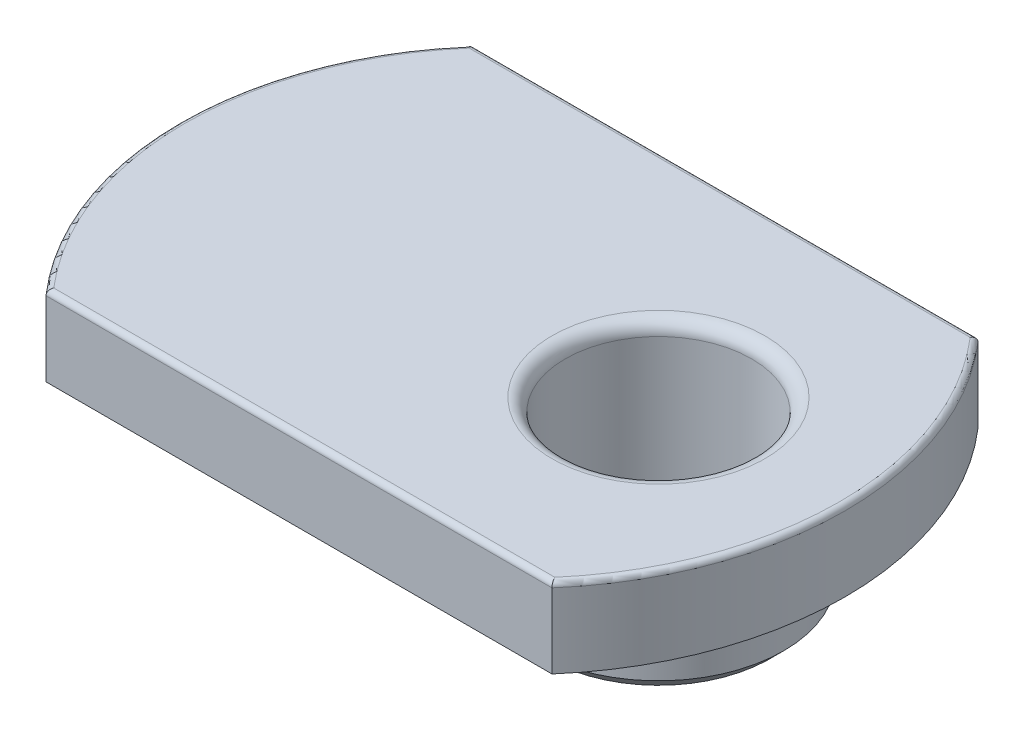
ISO-10303-21;
HEADER;
FILE_DESCRIPTION(('STEP AP214'),'2;1');
FILE_NAME('part.step','',(''),(''),'','','');
FILE_SCHEMA(('AUTOMOTIVE_DESIGN { 1 0 10303 214 1 1 1 1 }'));
ENDSEC;
DATA;
#1=APPLICATION_CONTEXT('core data for automotive mechanical design processes');
#2=APPLICATION_PROTOCOL_DEFINITION('international standard','automotive_design',2000,#1);
#3=PRODUCT_CONTEXT('',#1,'mechanical');
#4=PRODUCT('Part','Part','',(#3));
#5=PRODUCT_RELATED_PRODUCT_CATEGORY('part','',(#4));
#6=PRODUCT_DEFINITION_FORMATION('','',#4);
#7=PRODUCT_DEFINITION_CONTEXT('part definition',#1,'design');
#8=PRODUCT_DEFINITION('design','',#6,#7);
#9=PRODUCT_DEFINITION_SHAPE('','',#8);
#10=(LENGTH_UNIT() NAMED_UNIT(*) SI_UNIT(.MILLI.,.METRE.));
#11=(NAMED_UNIT(*) PLANE_ANGLE_UNIT() SI_UNIT($,.RADIAN.));
#12=(NAMED_UNIT(*) SI_UNIT($,.STERADIAN.) SOLID_ANGLE_UNIT());
#13=UNCERTAINTY_MEASURE_WITH_UNIT(LENGTH_MEASURE(1.E-05),#10,'distance_accuracy_value','');
#14=(GEOMETRIC_REPRESENTATION_CONTEXT(3) GLOBAL_UNCERTAINTY_ASSIGNED_CONTEXT((#13)) GLOBAL_UNIT_ASSIGNED_CONTEXT((#10,
#11,#12)) REPRESENTATION_CONTEXT('',''));
#15=CARTESIAN_POINT('',(0.,0.,0.));
#16=DIRECTION('',(0.,0.,1.));
#17=DIRECTION('',(1.,0.,0.));
#18=AXIS2_PLACEMENT_3D('',#15,#16,#17);
#19=CARTESIAN_POINT('',(0.333333333333326,3.,0.));
#20=DIRECTION('',(0.,-1.,0.));
#21=DIRECTION('',(0.,0.,-1.));
#22=AXIS2_PLACEMENT_3D('',#19,#20,#21);
#23=CYLINDRICAL_SURFACE('',#22,12.1666666666667);
#24=DIRECTION('',(0.,-1.,0.));
#25=VECTOR('',#24,1.);
#26=CARTESIAN_POINT('',(9.5,3.,-8.00000000000001));
#27=LINE('',#26,#25);
#28=CARTESIAN_POINT('',(9.5,2.8,-8.00000000000001));
#29=VERTEX_POINT('',#28);
#30=CARTESIAN_POINT('',(9.5,0.,-8.00000000000001));
#31=VERTEX_POINT('',#30);
#32=EDGE_CURVE('E72',#29,#31,#27,.T.);
#33=ORIENTED_EDGE('',*,*,#32,.F.);
#34=CARTESIAN_POINT('',(0.333333333333326,2.8,0.));
#35=DIRECTION('',(0.,-1.,0.));
#36=DIRECTION('',(0.,0.,-1.));
#37=AXIS2_PLACEMENT_3D('',#34,#35,#36);
#38=CIRCLE('',#37,12.1666666666667);
#39=CARTESIAN_POINT('',(9.5,2.8,8.00000000000001));
#40=VERTEX_POINT('',#39);
#41=EDGE_CURVE('E132',#29,#40,#38,.T.);
#42=ORIENTED_EDGE('',*,*,#41,.T.);
#43=DIRECTION('',(0.,-1.,0.));
#44=VECTOR('',#43,1.);
#45=CARTESIAN_POINT('',(9.5,3.,8.00000000000001));
#46=LINE('',#45,#44);
#47=CARTESIAN_POINT('',(9.5,0.,8.00000000000001));
#48=VERTEX_POINT('',#47);
#49=EDGE_CURVE('E92',#40,#48,#46,.T.);
#50=ORIENTED_EDGE('',*,*,#49,.T.);
#51=CARTESIAN_POINT('',(0.333333333333326,0.,0.));
#52=DIRECTION('',(0.,1.,0.));
#53=DIRECTION('',(0.,0.,-1.));
#54=AXIS2_PLACEMENT_3D('',#51,#52,#53);
#55=CIRCLE('',#54,12.1666666666667);
#56=EDGE_CURVE('E87',#48,#31,#55,.T.);
#57=ORIENTED_EDGE('',*,*,#56,.T.);
#58=EDGE_LOOP('',(#33,#42,#50,#57));
#59=FACE_BOUND('',#58,.T.);
#60=ADVANCED_FACE('F16',(#59),#23,.T.);
#61=CARTESIAN_POINT('',(-9.5,3.,-8.));
#62=DIRECTION('',(0.,0.,1.));
#63=DIRECTION('',(1.,0.,0.));
#64=AXIS2_PLACEMENT_3D('',#61,#62,#63);
#65=PLANE('',#64);
#66=DIRECTION('',(0.,-1.,0.));
#67=VECTOR('',#66,1.);
#68=CARTESIAN_POINT('',(-9.5,3.,-8.));
#69=LINE('',#68,#67);
#70=CARTESIAN_POINT('',(-9.5,2.8,-8.));
#71=VERTEX_POINT('',#70);
#72=CARTESIAN_POINT('',(-9.5,0.,-8.));
#73=VERTEX_POINT('',#72);
#74=EDGE_CURVE('E81',#71,#73,#69,.T.);
#75=ORIENTED_EDGE('',*,*,#74,.F.);
#76=DIRECTION('',(-1.,0.,0.));
#77=VECTOR('',#76,1.);
#78=CARTESIAN_POINT('',(-9.5,2.8,-8.));
#79=LINE('',#78,#77);
#80=EDGE_CURVE('E30',#71,#29,#79,.F.);
#81=ORIENTED_EDGE('',*,*,#80,.T.);
#82=ORIENTED_EDGE('',*,*,#32,.T.);
#83=DIRECTION('',(-1.,0.,0.));
#84=VECTOR('',#83,1.);
#85=CARTESIAN_POINT('',(-9.5,0.,-8.));
#86=LINE('',#85,#84);
#87=EDGE_CURVE('E75',#31,#73,#86,.T.);
#88=ORIENTED_EDGE('',*,*,#87,.T.);
#89=EDGE_LOOP('',(#75,#81,#82,#88));
#90=FACE_BOUND('',#89,.T.);
#91=ADVANCED_FACE('F74',(#90),#65,.F.);
#92=CARTESIAN_POINT('',(-0.333333333333324,3.,0.));
#93=DIRECTION('',(0.,-1.,0.));
#94=DIRECTION('',(0.,0.,-1.));
#95=AXIS2_PLACEMENT_3D('',#92,#93,#94);
#96=CYLINDRICAL_SURFACE('',#95,12.1666666666667);
#97=DIRECTION('',(0.,-1.,0.));
#98=VECTOR('',#97,1.);
#99=CARTESIAN_POINT('',(-9.50000000000001,3.,7.99999999999999));
#100=LINE('',#99,#98);
#101=CARTESIAN_POINT('',(-9.50000000000001,2.8,7.99999999999999));
#102=VERTEX_POINT('',#101);
#103=CARTESIAN_POINT('',(-9.50000000000001,0.,7.99999999999999));
#104=VERTEX_POINT('',#103);
#105=EDGE_CURVE('E103',#102,#104,#100,.T.);
#106=ORIENTED_EDGE('',*,*,#105,.F.);
#107=CARTESIAN_POINT('',(-0.333333333333324,2.8,0.));
#108=DIRECTION('',(0.,-1.,0.));
#109=DIRECTION('',(0.,0.,-1.));
#110=AXIS2_PLACEMENT_3D('',#107,#108,#109);
#111=CIRCLE('',#110,12.1666666666667);
#112=EDGE_CURVE('E10',#102,#71,#111,.T.);
#113=ORIENTED_EDGE('',*,*,#112,.T.);
#114=ORIENTED_EDGE('',*,*,#74,.T.);
#115=CARTESIAN_POINT('',(-0.333333333333324,0.,0.));
#116=DIRECTION('',(0.,1.,0.));
#117=DIRECTION('',(0.,0.,1.));
#118=AXIS2_PLACEMENT_3D('',#115,#116,#117);
#119=CIRCLE('',#118,12.1666666666667);
#120=EDGE_CURVE('E89',#73,#104,#119,.T.);
#121=ORIENTED_EDGE('',*,*,#120,.T.);
#122=EDGE_LOOP('',(#106,#113,#114,#121));
#123=FACE_BOUND('',#122,.T.);
#124=ADVANCED_FACE('F177',(#123),#96,.T.);
#125=CARTESIAN_POINT('',(-9.5,3.,8.));
#126=DIRECTION('',(0.,0.,-1.));
#127=DIRECTION('',(-1.,0.,0.));
#128=AXIS2_PLACEMENT_3D('',#125,#126,#127);
#129=PLANE('',#128);
#130=ORIENTED_EDGE('',*,*,#49,.F.);
#131=DIRECTION('',(1.,0.,0.));
#132=VECTOR('',#131,1.);
#133=CARTESIAN_POINT('',(-9.5,2.8,8.));
#134=LINE('',#133,#132);
#135=EDGE_CURVE('E129',#40,#102,#134,.F.);
#136=ORIENTED_EDGE('',*,*,#135,.T.);
#137=ORIENTED_EDGE('',*,*,#105,.T.);
#138=DIRECTION('',(1.,0.,0.));
#139=VECTOR('',#138,1.);
#140=CARTESIAN_POINT('',(-9.5,0.,8.));
#141=LINE('',#140,#139);
#142=EDGE_CURVE('E100',#104,#48,#141,.T.);
#143=ORIENTED_EDGE('',*,*,#142,.T.);
#144=EDGE_LOOP('',(#130,#136,#137,#143));
#145=FACE_BOUND('',#144,.T.);
#146=ADVANCED_FACE('F176',(#145),#129,.F.);
#147=CARTESIAN_POINT('',(0.333333333333326,3.,0.));
#148=DIRECTION('',(0.,-1.,0.));
#149=DIRECTION('',(0.,0.,-1.));
#150=AXIS2_PLACEMENT_3D('',#147,#148,#149);
#151=PLANE('',#150);
#152=CARTESIAN_POINT('',(-0.333333333333324,3.,0.));
#153=DIRECTION('',(0.,-1.,0.));
#154=DIRECTION('',(0.,0.,-1.));
#155=AXIS2_PLACEMENT_3D('',#152,#153,#154);
#156=CIRCLE('',#155,11.9666666666667);
#157=CARTESIAN_POINT('',(-9.40863559337465,3.,-7.8));
#158=VERTEX_POINT('',#157);
#159=CARTESIAN_POINT('',(-9.40863559337465,3.,7.8));
#160=VERTEX_POINT('',#159);
#161=EDGE_CURVE('E120',#158,#160,#156,.F.);
#162=ORIENTED_EDGE('',*,*,#161,.T.);
#163=DIRECTION('',(1.,0.,0.));
#164=VECTOR('',#163,1.);
#165=CARTESIAN_POINT('',(0.333333333333324,3.,7.8));
#166=LINE('',#165,#164);
#167=CARTESIAN_POINT('',(9.40863559337465,3.,7.80000000000001));
#168=VERTEX_POINT('',#167);
#169=EDGE_CURVE('E126',#160,#168,#166,.T.);
#170=ORIENTED_EDGE('',*,*,#169,.T.);
#171=CARTESIAN_POINT('',(0.333333333333326,3.,0.));
#172=DIRECTION('',(0.,-1.,0.));
#173=DIRECTION('',(0.,0.,-1.));
#174=AXIS2_PLACEMENT_3D('',#171,#172,#173);
#175=CIRCLE('',#174,11.9666666666667);
#176=CARTESIAN_POINT('',(9.40863559337465,3.,-7.80000000000001));
#177=VERTEX_POINT('',#176);
#178=EDGE_CURVE('E124',#168,#177,#175,.F.);
#179=ORIENTED_EDGE('',*,*,#178,.T.);
#180=DIRECTION('',(-1.,0.,0.));
#181=VECTOR('',#180,1.);
#182=CARTESIAN_POINT('',(0.333333333333324,3.,-7.8));
#183=LINE('',#182,#181);
#184=EDGE_CURVE('E122',#177,#158,#183,.T.);
#185=ORIENTED_EDGE('',*,*,#184,.T.);
#186=EDGE_LOOP('',(#162,#170,#179,#185));
#187=FACE_BOUND('',#186,.T.);
#188=CARTESIAN_POINT('',(5.5,3.,0.));
#189=DIRECTION('',(0.,-1.,0.));
#190=DIRECTION('',(0.,0.,-1.));
#191=AXIS2_PLACEMENT_3D('',#188,#189,#190);
#192=CIRCLE('',#191,4.);
#193=CARTESIAN_POINT('',(5.5,3.,-4.));
#194=VERTEX_POINT('',#193);
#195=EDGE_CURVE('E111',#194,#194,#192,.T.);
#196=ORIENTED_EDGE('',*,*,#195,.T.);
#197=EDGE_LOOP('',(#196));
#198=FACE_BOUND('',#197,.T.);
#199=ADVANCED_FACE('F181',(#187,#198),#151,.F.);
#200=CARTESIAN_POINT('',(0.333333333333326,0.,0.));
#201=DIRECTION('',(0.,-1.,0.));
#202=DIRECTION('',(0.,0.,-1.));
#203=AXIS2_PLACEMENT_3D('',#200,#201,#202);
#204=PLANE('',#203);
#205=CARTESIAN_POINT('',(5.5,0.,0.));
#206=DIRECTION('',(0.,-1.,0.));
#207=DIRECTION('',(0.,0.,-1.));
#208=AXIS2_PLACEMENT_3D('',#205,#206,#207);
#209=CIRCLE('',#208,4.7);
#210=CARTESIAN_POINT('',(5.5,0.,-4.7));
#211=VERTEX_POINT('',#210);
#212=EDGE_CURVE('E80',#211,#211,#209,.T.);
#213=ORIENTED_EDGE('',*,*,#212,.F.);
#214=EDGE_LOOP('',(#213));
#215=FACE_BOUND('',#214,.T.);
#216=ORIENTED_EDGE('',*,*,#56,.F.);
#217=ORIENTED_EDGE('',*,*,#142,.F.);
#218=ORIENTED_EDGE('',*,*,#120,.F.);
#219=ORIENTED_EDGE('',*,*,#87,.F.);
#220=EDGE_LOOP('',(#216,#217,#218,#219));
#221=FACE_BOUND('',#220,.T.);
#222=ADVANCED_FACE('F85',(#215,#221),#204,.T.);
#223=CARTESIAN_POINT('',(5.5,-3.4,0.));
#224=DIRECTION('',(0.,1.,0.));
#225=DIRECTION('',(0.,0.,1.));
#226=AXIS2_PLACEMENT_3D('',#223,#224,#225);
#227=CYLINDRICAL_SURFACE('',#226,4.7);
#228=CARTESIAN_POINT('',(5.5,-2.9,0.));
#229=DIRECTION('',(0.,1.,0.));
#230=DIRECTION('',(0.,0.,1.));
#231=AXIS2_PLACEMENT_3D('',#228,#229,#230);
#232=CIRCLE('',#231,4.7);
#233=CARTESIAN_POINT('',(5.5,-2.9,4.7));
#234=VERTEX_POINT('',#233);
#235=EDGE_CURVE('E114',#234,#234,#232,.T.);
#236=ORIENTED_EDGE('',*,*,#235,.T.);
#237=EDGE_LOOP('',(#236));
#238=FACE_BOUND('',#237,.T.);
#239=ORIENTED_EDGE('',*,*,#212,.T.);
#240=EDGE_LOOP('',(#239));
#241=FACE_BOUND('',#240,.T.);
#242=ADVANCED_FACE('F202',(#238,#241),#227,.T.);
#243=CARTESIAN_POINT('',(5.5,-3.4,0.));
#244=DIRECTION('',(0.,1.,0.));
#245=DIRECTION('',(0.,0.,1.));
#246=AXIS2_PLACEMENT_3D('',#243,#244,#245);
#247=PLANE('',#246);
#248=CARTESIAN_POINT('',(5.5,-3.4,0.));
#249=DIRECTION('',(0.,1.,0.));
#250=DIRECTION('',(0.,0.,1.));
#251=AXIS2_PLACEMENT_3D('',#248,#249,#250);
#252=CIRCLE('',#251,4.2);
#253=CARTESIAN_POINT('',(5.5,-3.4,4.2));
#254=VERTEX_POINT('',#253);
#255=EDGE_CURVE('E117',#254,#254,#252,.F.);
#256=ORIENTED_EDGE('',*,*,#255,.T.);
#257=EDGE_LOOP('',(#256));
#258=FACE_BOUND('',#257,.T.);
#259=CARTESIAN_POINT('',(5.5,-3.4,0.));
#260=DIRECTION('',(0.,1.,0.));
#261=DIRECTION('',(0.,0.,1.));
#262=AXIS2_PLACEMENT_3D('',#259,#260,#261);
#263=CIRCLE('',#262,3.5);
#264=CARTESIAN_POINT('',(5.5,-3.4,3.5));
#265=VERTEX_POINT('',#264);
#266=EDGE_CURVE('E94',#265,#265,#263,.T.);
#267=ORIENTED_EDGE('',*,*,#266,.T.);
#268=EDGE_LOOP('',(#267));
#269=FACE_BOUND('',#268,.T.);
#270=ADVANCED_FACE('F197',(#258,#269),#247,.F.);
#271=CARTESIAN_POINT('',(5.5,-3.4,0.));
#272=DIRECTION('',(0.,1.,0.));
#273=DIRECTION('',(0.,0.,1.));
#274=AXIS2_PLACEMENT_3D('',#271,#272,#273);
#275=CYLINDRICAL_SURFACE('',#274,3.5);
#276=CARTESIAN_POINT('',(5.5,2.5,0.));
#277=DIRECTION('',(0.,-1.,0.));
#278=DIRECTION('',(0.,0.,-1.));
#279=AXIS2_PLACEMENT_3D('',#276,#277,#278);
#280=CIRCLE('',#279,3.5);
#281=CARTESIAN_POINT('',(5.5,2.5,-3.5));
#282=VERTEX_POINT('',#281);
#283=EDGE_CURVE('E108',#282,#282,#280,.F.);
#284=ORIENTED_EDGE('',*,*,#283,.T.);
#285=EDGE_LOOP('',(#284));
#286=FACE_BOUND('',#285,.T.);
#287=ORIENTED_EDGE('',*,*,#266,.F.);
#288=EDGE_LOOP('',(#287));
#289=FACE_BOUND('',#288,.T.);
#290=ADVANCED_FACE('F191',(#286,#289),#275,.F.);
#291=CARTESIAN_POINT('',(5.5,2.5,0.));
#292=DIRECTION('',(0.,-1.,0.));
#293=DIRECTION('',(0.,0.,-1.));
#294=AXIS2_PLACEMENT_3D('',#291,#292,#293);
#295=TOROIDAL_SURFACE('',#294,4.,0.5);
#296=ORIENTED_EDGE('',*,*,#195,.F.);
#297=EDGE_LOOP('',(#296));
#298=FACE_BOUND('',#297,.T.);
#299=ORIENTED_EDGE('',*,*,#283,.F.);
#300=EDGE_LOOP('',(#299));
#301=FACE_BOUND('',#300,.T.);
#302=ADVANCED_FACE('F187',(#298,#301),#295,.T.);
#303=CARTESIAN_POINT('',(5.5,-2.9,0.));
#304=DIRECTION('',(0.,1.,0.));
#305=DIRECTION('',(0.,0.,1.));
#306=AXIS2_PLACEMENT_3D('',#303,#304,#305);
#307=CONICAL_SURFACE('',#306,4.7,0.785398163397454);
#308=ORIENTED_EDGE('',*,*,#255,.F.);
#309=EDGE_LOOP('',(#308));
#310=FACE_BOUND('',#309,.T.);
#311=ORIENTED_EDGE('',*,*,#235,.F.);
#312=EDGE_LOOP('',(#311));
#313=FACE_BOUND('',#312,.T.);
#314=ADVANCED_FACE('F190',(#310,#313),#307,.T.);
#315=CARTESIAN_POINT('',(0.333333333333324,2.8,-7.8));
#316=DIRECTION('',(-1.,0.,0.));
#317=DIRECTION('',(0.,0.,1.));
#318=AXIS2_PLACEMENT_3D('',#315,#316,#317);
#319=CYLINDRICAL_SURFACE('',#318,0.2);
#320=CARTESIAN_POINT('',(9.5,2.8,-8.00000000000001));
#321=CARTESIAN_POINT('',(9.50000550773872,2.81052686573057,-8.00001231347368));
#322=CARTESIAN_POINT('',(9.49962261417545,2.82104508503684,-7.9991697519459));
#323=CARTESIAN_POINT('',(9.49812359158818,2.84173916124319,-7.99587220544365));
#324=CARTESIAN_POINT('',(9.49700977708411,2.85191599260397,-7.99342231022606));
#325=CARTESIAN_POINT('',(9.494092573379,2.87166828965124,-7.98700761087605));
#326=CARTESIAN_POINT('',(9.49228946056287,2.88124399457945,-7.98304341392697));
#327=CARTESIAN_POINT('',(9.48806448906931,2.89956651906865,-7.97375843326175));
#328=CARTESIAN_POINT('',(9.48564233650279,2.90831294221667,-7.96843700520263));
#329=CARTESIAN_POINT('',(9.4801652429374,2.92508516936808,-7.95640981643723));
#330=CARTESIAN_POINT('',(9.47709063131787,2.93307360920113,-7.94966105222928));
#331=CARTESIAN_POINT('',(9.47046489790844,2.94781116551262,-7.93512613741905));
#332=CARTESIAN_POINT('',(9.46691361945866,2.95455987280977,-7.92733964576638));
#333=CARTESIAN_POINT('',(9.45911443095121,2.96723468228057,-7.91025037028477));
#334=CARTESIAN_POINT('',(9.45483296439409,2.97304208665028,-7.90087495736572));
#335=CARTESIAN_POINT('',(9.44594329290359,2.9830018174255,-7.8814235297573));
#336=CARTESIAN_POINT('',(9.4413349442053,2.98715341021128,-7.87134720684129));
#337=CARTESIAN_POINT('',(9.43230134536942,2.99348046878275,-7.85161068859139));
#338=CARTESIAN_POINT('',(9.42789281570729,2.99579172918783,-7.84198573917162));
#339=CARTESIAN_POINT('',(9.41898691254831,2.99896681922522,-7.82255641203511));
#340=CARTESIAN_POINT('',(9.41448972601697,2.99983342122318,-7.81275241457572));
#341=CARTESIAN_POINT('',(9.40953898743967,2.99999275469416,-7.80196773070985));
#342=CARTESIAN_POINT('',(9.40908727617098,3.00000001632601,-7.80098379723589));
#343=CARTESIAN_POINT('',(9.40863559337465,3.,-7.80000000000001));
#344=B_SPLINE_CURVE_WITH_KNOTS('',3,(#320,#321,#322,#323,#324,#325,#326,#327,#328,#329,#330,
#331,#332,#333,#334,#335,#336,#337,#338,#339,#340,#341,#342,#343),.UNSPECIFIED.,.F.,.F.,(4,2,2,
2,2,2,2,2,2,2,2,4),(0.,0.0315265272354055,0.0629537018137739,0.0943682883715399,
0.12579781679785,0.15836082108097,0.190934553747698,0.226277334101784,0.26163575599076,
0.294049077723656,0.32640012489754,0.329648085916069),.UNSPECIFIED.);
#345=EDGE_CURVE('E158',#29,#177,#344,.T.);
#346=ORIENTED_EDGE('',*,*,#345,.F.);
#347=ORIENTED_EDGE('',*,*,#80,.F.);
#348=CARTESIAN_POINT('',(-9.5,2.8,-8.));
#349=CARTESIAN_POINT('',(-9.50000550773873,2.81052686573057,-8.00001231347367));
#350=CARTESIAN_POINT('',(-9.49962261417545,2.82104508503684,-7.9991697519459));
#351=CARTESIAN_POINT('',(-9.49812359158819,2.84173916124319,-7.99587220544364));
#352=CARTESIAN_POINT('',(-9.49700977708411,2.85191599260397,-7.99342231022606));
#353=CARTESIAN_POINT('',(-9.49409257337901,2.87166828965124,-7.98700761087604));
#354=CARTESIAN_POINT('',(-9.49228946056287,2.88124399457945,-7.98304341392696));
#355=CARTESIAN_POINT('',(-9.48806448906932,2.89956651906865,-7.97375843326174));
#356=CARTESIAN_POINT('',(-9.48564233650279,2.90831294221667,-7.96843700520263));
#357=CARTESIAN_POINT('',(-9.48016524293741,2.92508516936808,-7.95640981643723));
#358=CARTESIAN_POINT('',(-9.47709063131788,2.93307360920112,-7.94966105222928));
#359=CARTESIAN_POINT('',(-9.47046489790845,2.94781116551262,-7.93512613741904));
#360=CARTESIAN_POINT('',(-9.46691361945867,2.95455987280977,-7.92733964576637));
#361=CARTESIAN_POINT('',(-9.45911443095122,2.96723468228057,-7.91025037028477));
#362=CARTESIAN_POINT('',(-9.45483296439409,2.97304208665028,-7.90087495736571));
#363=CARTESIAN_POINT('',(-9.44594329290358,2.9830018174255,-7.8814235297573));
#364=CARTESIAN_POINT('',(-9.4413349442053,2.98715341021128,-7.87134720684129));
#365=CARTESIAN_POINT('',(-9.43230134536942,2.99348046878275,-7.85161068859139));
#366=CARTESIAN_POINT('',(-9.42789281570729,2.99579172918783,-7.84198573917161));
#367=CARTESIAN_POINT('',(-9.41898691254832,2.99896681922522,-7.8225564120351));
#368=CARTESIAN_POINT('',(-9.41448972601698,2.99983342122318,-7.81275241457571));
#369=CARTESIAN_POINT('',(-9.40953898743968,2.99999275469416,-7.80196773070985));
#370=CARTESIAN_POINT('',(-9.40908727617099,3.00000001632601,-7.80098379723588));
#371=CARTESIAN_POINT('',(-9.40863559337465,3.,-7.8));
#372=B_SPLINE_CURVE_WITH_KNOTS('',3,(#348,#349,#350,#351,#352,#353,#354,#355,#356,#357,#358,
#359,#360,#361,#362,#363,#364,#365,#366,#367,#368,#369,#370,#371),.UNSPECIFIED.,.F.,.F.,(4,2,2,
2,2,2,2,2,2,2,2,4),(0.,0.0315265272354051,0.0629537018137734,0.0943682883715393,
0.125797816797849,0.158360821080969,0.190934553747697,0.226277334101783,0.261635755990758,
0.294049077723656,0.32640012489754,0.329648085916069),.UNSPECIFIED.);
#373=EDGE_CURVE('E21',#158,#71,#372,.F.);
#374=ORIENTED_EDGE('',*,*,#373,.F.);
#375=ORIENTED_EDGE('',*,*,#184,.F.);
#376=EDGE_LOOP('',(#346,#347,#374,#375));
#377=FACE_BOUND('',#376,.T.);
#378=ADVANCED_FACE('F18',(#377),#319,.T.);
#379=CARTESIAN_POINT('',(-0.333333333333324,2.8,0.));
#380=DIRECTION('',(0.,-1.,0.));
#381=DIRECTION('',(0.,0.,-1.));
#382=AXIS2_PLACEMENT_3D('',#379,#380,#381);
#383=TOROIDAL_SURFACE('',#382,11.9666666666667,0.2);
#384=ORIENTED_EDGE('',*,*,#373,.T.);
#385=ORIENTED_EDGE('',*,*,#112,.F.);
#386=CARTESIAN_POINT('',(-9.50000000000001,2.8,8.));
#387=CARTESIAN_POINT('',(-9.50000550773873,2.81052686573057,8.00001231347367));
#388=CARTESIAN_POINT('',(-9.49962261417545,2.82104508503684,7.9991697519459));
#389=CARTESIAN_POINT('',(-9.49812359158819,2.84173916124319,7.99587220544364));
#390=CARTESIAN_POINT('',(-9.49700977708411,2.85191599260397,7.99342231022606));
#391=CARTESIAN_POINT('',(-9.49409257337901,2.87166828965124,7.98700761087604));
#392=CARTESIAN_POINT('',(-9.49228946056287,2.88124399457945,7.98304341392696));
#393=CARTESIAN_POINT('',(-9.48806448906932,2.89956651906865,7.97375843326174));
#394=CARTESIAN_POINT('',(-9.48564233650279,2.90831294221667,7.96843700520263));
#395=CARTESIAN_POINT('',(-9.48016524293741,2.92508516936808,7.95640981643723));
#396=CARTESIAN_POINT('',(-9.47709063131788,2.93307360920112,7.94966105222928));
#397=CARTESIAN_POINT('',(-9.47046489790844,2.94781116551262,7.93512613741904));
#398=CARTESIAN_POINT('',(-9.46691361945867,2.95455987280977,7.92733964576637));
#399=CARTESIAN_POINT('',(-9.45911443095122,2.96723468228057,7.91025037028477));
#400=CARTESIAN_POINT('',(-9.45483296439409,2.97304208665028,7.90087495736571));
#401=CARTESIAN_POINT('',(-9.44594329290358,2.9830018174255,7.8814235297573));
#402=CARTESIAN_POINT('',(-9.4413349442053,2.98715341021128,7.87134720684129));
#403=CARTESIAN_POINT('',(-9.43230134536942,2.99348046878275,7.85161068859139));
#404=CARTESIAN_POINT('',(-9.42789281570729,2.99579172918783,7.84198573917161));
#405=CARTESIAN_POINT('',(-9.41898691254832,2.99896681922522,7.8225564120351));
#406=CARTESIAN_POINT('',(-9.41448972601698,2.99983342122318,7.81275241457571));
#407=CARTESIAN_POINT('',(-9.40953898743968,2.99999275469416,7.80196773070985));
#408=CARTESIAN_POINT('',(-9.40908727617099,3.00000001632601,7.80098379723588));
#409=CARTESIAN_POINT('',(-9.40863559337465,3.,7.8));
#410=B_SPLINE_CURVE_WITH_KNOTS('',3,(#386,#387,#388,#389,#390,#391,#392,#393,#394,#395,#396,
#397,#398,#399,#400,#401,#402,#403,#404,#405,#406,#407,#408,#409),.UNSPECIFIED.,.F.,.F.,(4,2,2,
2,2,2,2,2,2,2,2,4),(0.,0.0315265272354053,0.0629537018137733,0.0943682883715391,
0.125797816797849,0.158360821080969,0.190934553747697,0.226277334101783,0.261635755990758,
0.294049077723656,0.32640012489754,0.329648085916069),.UNSPECIFIED.);
#411=EDGE_CURVE('E143',#160,#102,#410,.F.);
#412=ORIENTED_EDGE('',*,*,#411,.F.);
#413=ORIENTED_EDGE('',*,*,#161,.F.);
#414=EDGE_LOOP('',(#384,#385,#412,#413));
#415=FACE_BOUND('',#414,.T.);
#416=ADVANCED_FACE('F154',(#415),#383,.T.);
#417=CARTESIAN_POINT('',(0.333333333333326,2.8,0.));
#418=DIRECTION('',(0.,-1.,0.));
#419=DIRECTION('',(0.,0.,-1.));
#420=AXIS2_PLACEMENT_3D('',#417,#418,#419);
#421=TOROIDAL_SURFACE('',#420,11.9666666666667,0.2);
#422=ORIENTED_EDGE('',*,*,#345,.T.);
#423=ORIENTED_EDGE('',*,*,#178,.F.);
#424=CARTESIAN_POINT('',(9.5,2.8,8.00000000000001));
#425=CARTESIAN_POINT('',(9.50000550773872,2.81052686573057,8.00001231347368));
#426=CARTESIAN_POINT('',(9.49962261417545,2.82104508503684,7.9991697519459));
#427=CARTESIAN_POINT('',(9.49812359158818,2.84173916124319,7.99587220544365));
#428=CARTESIAN_POINT('',(9.49700977708411,2.85191599260397,7.99342231022606));
#429=CARTESIAN_POINT('',(9.494092573379,2.87166828965124,7.98700761087605));
#430=CARTESIAN_POINT('',(9.49228946056287,2.88124399457945,7.98304341392697));
#431=CARTESIAN_POINT('',(9.48806448906931,2.89956651906865,7.97375843326175));
#432=CARTESIAN_POINT('',(9.48564233650279,2.90831294221667,7.96843700520263));
#433=CARTESIAN_POINT('',(9.4801652429374,2.92508516936808,7.95640981643723));
#434=CARTESIAN_POINT('',(9.47709063131787,2.93307360920113,7.94966105222928));
#435=CARTESIAN_POINT('',(9.47046489790844,2.94781116551262,7.93512613741905));
#436=CARTESIAN_POINT('',(9.46691361945866,2.95455987280977,7.92733964576638));
#437=CARTESIAN_POINT('',(9.45911443095121,2.96723468228057,7.91025037028477));
#438=CARTESIAN_POINT('',(9.45483296439409,2.97304208665028,7.90087495736572));
#439=CARTESIAN_POINT('',(9.44594329290359,2.9830018174255,7.8814235297573));
#440=CARTESIAN_POINT('',(9.4413349442053,2.98715341021128,7.87134720684129));
#441=CARTESIAN_POINT('',(9.43230134536942,2.99348046878275,7.85161068859139));
#442=CARTESIAN_POINT('',(9.42789281570729,2.99579172918783,7.84198573917162));
#443=CARTESIAN_POINT('',(9.41898691254831,2.99896681922522,7.82255641203511));
#444=CARTESIAN_POINT('',(9.41448972601697,2.99983342122318,7.81275241457572));
#445=CARTESIAN_POINT('',(9.40953898743967,2.99999275469416,7.80196773070985));
#446=CARTESIAN_POINT('',(9.40908727617098,3.00000001632601,7.80098379723589));
#447=CARTESIAN_POINT('',(9.40863559337465,3.,7.80000000000001));
#448=B_SPLINE_CURVE_WITH_KNOTS('',3,(#424,#425,#426,#427,#428,#429,#430,#431,#432,#433,#434,
#435,#436,#437,#438,#439,#440,#441,#442,#443,#444,#445,#446,#447),.UNSPECIFIED.,.F.,.F.,(4,2,2,
2,2,2,2,2,2,2,2,4),(0.,0.0315265272354055,0.0629537018137739,0.0943682883715399,
0.12579781679785,0.15836082108097,0.190934553747698,0.226277334101784,0.26163575599076,
0.294049077723656,0.32640012489754,0.329648085916069),.UNSPECIFIED.);
#449=EDGE_CURVE('E135',#40,#168,#448,.T.);
#450=ORIENTED_EDGE('',*,*,#449,.F.);
#451=ORIENTED_EDGE('',*,*,#41,.F.);
#452=EDGE_LOOP('',(#422,#423,#450,#451));
#453=FACE_BOUND('',#452,.T.);
#454=ADVANCED_FACE('F151',(#453),#421,.T.);
#455=CARTESIAN_POINT('',(0.333333333333324,2.8,7.8));
#456=DIRECTION('',(1.,0.,0.));
#457=DIRECTION('',(0.,0.,-1.));
#458=AXIS2_PLACEMENT_3D('',#455,#456,#457);
#459=CYLINDRICAL_SURFACE('',#458,0.2);
#460=ORIENTED_EDGE('',*,*,#411,.T.);
#461=ORIENTED_EDGE('',*,*,#135,.F.);
#462=ORIENTED_EDGE('',*,*,#449,.T.);
#463=ORIENTED_EDGE('',*,*,#169,.F.);
#464=EDGE_LOOP('',(#460,#461,#462,#463));
#465=FACE_BOUND('',#464,.T.);
#466=ADVANCED_FACE('F148',(#465),#459,.T.);
#467=CLOSED_SHELL('',(#60,#91,#124,#146,#199,#222,#242,#270,#290,#302,#314,#378,#416,#454,#466));
#468=MANIFOLD_SOLID_BREP('B1',#467);
#469=ADVANCED_BREP_SHAPE_REPRESENTATION('',(#18,#468),#14);
#470=SHAPE_DEFINITION_REPRESENTATION(#9,#469);
ENDSEC;
END-ISO-10303-21;
